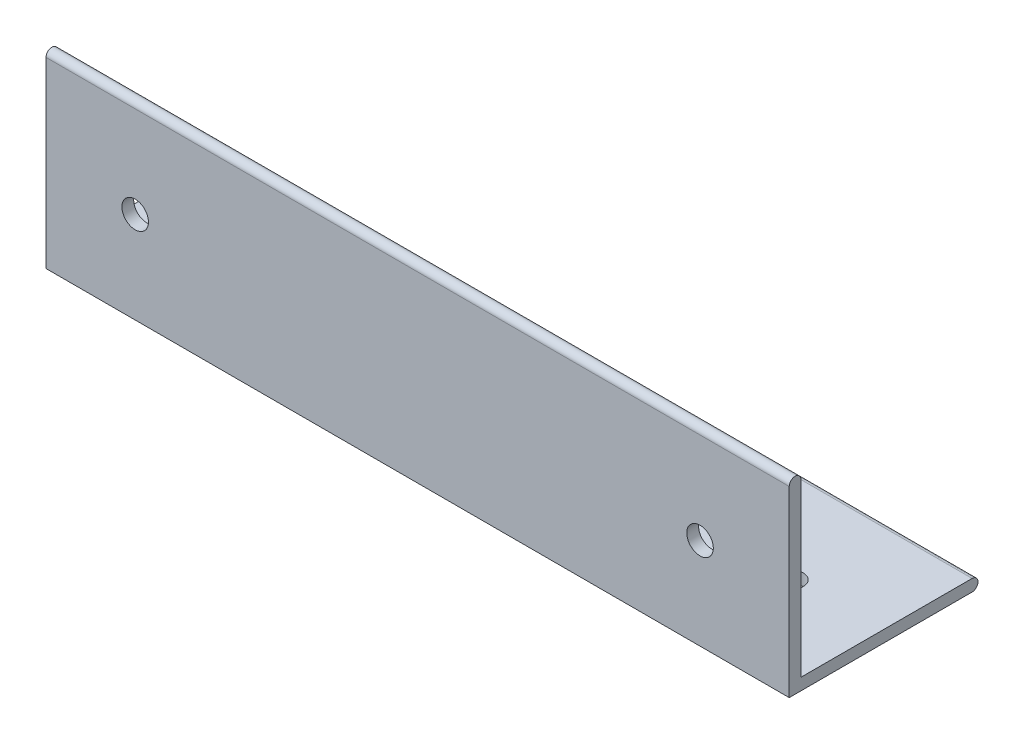
ISO-10303-21;
HEADER;
FILE_DESCRIPTION(('STEP AP214'),'2;1');
FILE_NAME('part.step','',(''),(''),'','','');
FILE_SCHEMA(('AUTOMOTIVE_DESIGN { 1 0 10303 214 1 1 1 1 }'));
ENDSEC;
DATA;
#1=APPLICATION_CONTEXT('core data for automotive mechanical design processes');
#2=APPLICATION_PROTOCOL_DEFINITION('international standard','automotive_design',2000,#1);
#3=PRODUCT_CONTEXT('',#1,'mechanical');
#4=PRODUCT('Part','Part','',(#3));
#5=PRODUCT_RELATED_PRODUCT_CATEGORY('part','',(#4));
#6=PRODUCT_DEFINITION_FORMATION('','',#4);
#7=PRODUCT_DEFINITION_CONTEXT('part definition',#1,'design');
#8=PRODUCT_DEFINITION('design','',#6,#7);
#9=PRODUCT_DEFINITION_SHAPE('','',#8);
#10=(LENGTH_UNIT() NAMED_UNIT(*) SI_UNIT(.MILLI.,.METRE.));
#11=(NAMED_UNIT(*) PLANE_ANGLE_UNIT() SI_UNIT($,.RADIAN.));
#12=(NAMED_UNIT(*) SI_UNIT($,.STERADIAN.) SOLID_ANGLE_UNIT());
#13=UNCERTAINTY_MEASURE_WITH_UNIT(LENGTH_MEASURE(1.E-05),#10,'distance_accuracy_value','');
#14=(GEOMETRIC_REPRESENTATION_CONTEXT(3) GLOBAL_UNCERTAINTY_ASSIGNED_CONTEXT((#13)) GLOBAL_UNIT_ASSIGNED_CONTEXT((#10,
#11,#12)) REPRESENTATION_CONTEXT('',''));
#15=CARTESIAN_POINT('',(0.,0.,0.));
#16=DIRECTION('',(0.,0.,1.));
#17=DIRECTION('',(1.,0.,0.));
#18=AXIS2_PLACEMENT_3D('',#15,#16,#17);
#19=CARTESIAN_POINT('',(100.,0.793749999999999,-24.60625));
#20=DIRECTION('',(-1.,0.,0.));
#21=DIRECTION('',(0.,0.,1.));
#22=AXIS2_PLACEMENT_3D('',#19,#20,#21);
#23=CYLINDRICAL_SURFACE('',#22,0.793749999999999);
#24=DIRECTION('',(-1.,0.,0.));
#25=VECTOR('',#24,1.);
#26=CARTESIAN_POINT('',(100.,1.5875,-24.60625));
#27=LINE('',#26,#25);
#28=CARTESIAN_POINT('',(100.,1.5875,-24.60625));
#29=VERTEX_POINT('',#28);
#30=CARTESIAN_POINT('',(0.,1.5875,-24.60625));
#31=VERTEX_POINT('',#30);
#32=EDGE_CURVE('E149',#29,#31,#27,.T.);
#33=ORIENTED_EDGE('',*,*,#32,.F.);
#34=CARTESIAN_POINT('',(100.,0.793749999999999,-24.60625));
#35=DIRECTION('',(-1.,0.,0.));
#36=DIRECTION('',(0.,0.,1.));
#37=AXIS2_PLACEMENT_3D('',#34,#35,#36);
#38=CIRCLE('',#37,0.793749999999999);
#39=CARTESIAN_POINT('',(100.,0.,-24.60625));
#40=VERTEX_POINT('',#39);
#41=EDGE_CURVE('E58',#40,#29,#38,.F.);
#42=ORIENTED_EDGE('',*,*,#41,.F.);
#43=DIRECTION('',(-1.,0.,0.));
#44=VECTOR('',#43,1.);
#45=CARTESIAN_POINT('',(100.,0.,-24.60625));
#46=LINE('',#45,#44);
#47=CARTESIAN_POINT('',(0.,0.,-24.60625));
#48=VERTEX_POINT('',#47);
#49=EDGE_CURVE('E151',#48,#40,#46,.F.);
#50=ORIENTED_EDGE('',*,*,#49,.F.);
#51=CARTESIAN_POINT('',(0.,0.793749999999999,-24.60625));
#52=DIRECTION('',(-1.,0.,0.));
#53=DIRECTION('',(0.,0.,1.));
#54=AXIS2_PLACEMENT_3D('',#51,#52,#53);
#55=CIRCLE('',#54,0.793749999999999);
#56=EDGE_CURVE('E13',#31,#48,#55,.T.);
#57=ORIENTED_EDGE('',*,*,#56,.F.);
#58=EDGE_LOOP('',(#33,#42,#50,#57));
#59=FACE_BOUND('',#58,.T.);
#60=ADVANCED_FACE('F49',(#59),#23,.T.);
#61=CARTESIAN_POINT('',(100.,24.60625,-0.79375));
#62=DIRECTION('',(-1.,0.,0.));
#63=DIRECTION('',(0.,0.,1.));
#64=AXIS2_PLACEMENT_3D('',#61,#62,#63);
#65=CYLINDRICAL_SURFACE('',#64,0.79375);
#66=DIRECTION('',(-1.,0.,0.));
#67=VECTOR('',#66,1.);
#68=CARTESIAN_POINT('',(100.,24.60625,0.));
#69=LINE('',#68,#67);
#70=CARTESIAN_POINT('',(100.,24.60625,0.));
#71=VERTEX_POINT('',#70);
#72=CARTESIAN_POINT('',(0.,24.60625,0.));
#73=VERTEX_POINT('',#72);
#74=EDGE_CURVE('E119',#71,#73,#69,.T.);
#75=ORIENTED_EDGE('',*,*,#74,.F.);
#76=CARTESIAN_POINT('',(100.,24.60625,-0.79375));
#77=DIRECTION('',(-1.,0.,0.));
#78=DIRECTION('',(0.,0.,1.));
#79=AXIS2_PLACEMENT_3D('',#76,#77,#78);
#80=CIRCLE('',#79,0.79375);
#81=CARTESIAN_POINT('',(100.,24.60625,-1.5875));
#82=VERTEX_POINT('',#81);
#83=EDGE_CURVE('E145',#82,#71,#80,.F.);
#84=ORIENTED_EDGE('',*,*,#83,.F.);
#85=DIRECTION('',(-1.,0.,0.));
#86=VECTOR('',#85,1.);
#87=CARTESIAN_POINT('',(100.,24.60625,-1.5875));
#88=LINE('',#87,#86);
#89=CARTESIAN_POINT('',(0.,24.60625,-1.5875));
#90=VERTEX_POINT('',#89);
#91=EDGE_CURVE('E125',#90,#82,#88,.F.);
#92=ORIENTED_EDGE('',*,*,#91,.F.);
#93=CARTESIAN_POINT('',(0.,24.60625,-0.79375));
#94=DIRECTION('',(-1.,0.,0.));
#95=DIRECTION('',(0.,0.,1.));
#96=AXIS2_PLACEMENT_3D('',#93,#94,#95);
#97=CIRCLE('',#96,0.79375);
#98=EDGE_CURVE('E147',#73,#90,#97,.T.);
#99=ORIENTED_EDGE('',*,*,#98,.F.);
#100=EDGE_LOOP('',(#75,#84,#92,#99));
#101=FACE_BOUND('',#100,.T.);
#102=ADVANCED_FACE('F186',(#101),#65,.T.);
#103=CARTESIAN_POINT('',(100.,0.,-25.4));
#104=DIRECTION('',(0.,1.,0.));
#105=DIRECTION('',(0.,0.,1.));
#106=AXIS2_PLACEMENT_3D('',#103,#104,#105);
#107=PLANE('',#106);
#108=CARTESIAN_POINT('',(12.,0.,-12.303125));
#109=DIRECTION('',(0.,-1.,0.));
#110=DIRECTION('',(0.,0.,-1.));
#111=AXIS2_PLACEMENT_3D('',#108,#109,#110);
#112=CIRCLE('',#111,1.785);
#113=CARTESIAN_POINT('',(12.,0.,-14.088125));
#114=VERTEX_POINT('',#113);
#115=EDGE_CURVE('E155',#114,#114,#112,.T.);
#116=ORIENTED_EDGE('',*,*,#115,.F.);
#117=EDGE_LOOP('',(#116));
#118=FACE_BOUND('',#117,.T.);
#119=CARTESIAN_POINT('',(88.,0.,-12.303125));
#120=DIRECTION('',(0.,-1.,0.));
#121=DIRECTION('',(0.,0.,-1.));
#122=AXIS2_PLACEMENT_3D('',#119,#120,#121);
#123=CIRCLE('',#122,1.5875);
#124=CARTESIAN_POINT('',(88.,0.,-13.890625));
#125=VERTEX_POINT('',#124);
#126=EDGE_CURVE('E161',#125,#125,#123,.T.);
#127=ORIENTED_EDGE('',*,*,#126,.F.);
#128=EDGE_LOOP('',(#127));
#129=FACE_BOUND('',#128,.T.);
#130=DIRECTION('',(0.,0.,-1.));
#131=VECTOR('',#130,1.);
#132=CARTESIAN_POINT('',(0.,0.,-25.4));
#133=LINE('',#132,#131);
#134=CARTESIAN_POINT('',(0.,0.,0.));
#135=VERTEX_POINT('',#134);
#136=EDGE_CURVE('E131',#135,#48,#133,.T.);
#137=ORIENTED_EDGE('',*,*,#136,.T.);
#138=ORIENTED_EDGE('',*,*,#49,.T.);
#139=DIRECTION('',(0.,0.,-1.));
#140=VECTOR('',#139,1.);
#141=CARTESIAN_POINT('',(100.,0.,-25.4));
#142=LINE('',#141,#140);
#143=CARTESIAN_POINT('',(100.,0.,0.));
#144=VERTEX_POINT('',#143);
#145=EDGE_CURVE('E110',#144,#40,#142,.T.);
#146=ORIENTED_EDGE('',*,*,#145,.F.);
#147=DIRECTION('',(-1.,0.,0.));
#148=VECTOR('',#147,1.);
#149=CARTESIAN_POINT('',(100.,0.,0.));
#150=LINE('',#149,#148);
#151=EDGE_CURVE('E120',#144,#135,#150,.T.);
#152=ORIENTED_EDGE('',*,*,#151,.T.);
#153=EDGE_LOOP('',(#137,#138,#146,#152));
#154=FACE_BOUND('',#153,.T.);
#155=ADVANCED_FACE('F181',(#118,#129,#154),#107,.F.);
#156=CARTESIAN_POINT('',(100.,1.5875,-1.5875));
#157=DIRECTION('',(0.,-1.,0.));
#158=DIRECTION('',(0.,0.,-1.));
#159=AXIS2_PLACEMENT_3D('',#156,#157,#158);
#160=PLANE('',#159);
#161=CARTESIAN_POINT('',(12.,1.5875,-12.303125));
#162=DIRECTION('',(0.,-1.,0.));
#163=DIRECTION('',(0.,0.,-1.));
#164=AXIS2_PLACEMENT_3D('',#161,#162,#163);
#165=CIRCLE('',#164,1.785);
#166=CARTESIAN_POINT('',(12.,1.5875,-14.088125));
#167=VERTEX_POINT('',#166);
#168=EDGE_CURVE('E53',#167,#167,#165,.T.);
#169=ORIENTED_EDGE('',*,*,#168,.T.);
#170=EDGE_LOOP('',(#169));
#171=FACE_BOUND('',#170,.T.);
#172=CARTESIAN_POINT('',(88.,1.5875,-12.303125));
#173=DIRECTION('',(0.,-1.,0.));
#174=DIRECTION('',(0.,0.,-1.));
#175=AXIS2_PLACEMENT_3D('',#172,#173,#174);
#176=CIRCLE('',#175,1.5875);
#177=CARTESIAN_POINT('',(88.,1.5875,-13.890625));
#178=VERTEX_POINT('',#177);
#179=EDGE_CURVE('E153',#178,#178,#176,.T.);
#180=ORIENTED_EDGE('',*,*,#179,.T.);
#181=EDGE_LOOP('',(#180));
#182=FACE_BOUND('',#181,.T.);
#183=DIRECTION('',(0.,0.,1.));
#184=VECTOR('',#183,1.);
#185=CARTESIAN_POINT('',(100.,1.5875,-1.5875));
#186=LINE('',#185,#184);
#187=CARTESIAN_POINT('',(100.,1.5875,-1.5875));
#188=VERTEX_POINT('',#187);
#189=EDGE_CURVE('E102',#29,#188,#186,.T.);
#190=ORIENTED_EDGE('',*,*,#189,.F.);
#191=ORIENTED_EDGE('',*,*,#32,.T.);
#192=DIRECTION('',(0.,0.,1.));
#193=VECTOR('',#192,1.);
#194=CARTESIAN_POINT('',(0.,1.5875,-1.5875));
#195=LINE('',#194,#193);
#196=CARTESIAN_POINT('',(0.,1.5875,-1.5875));
#197=VERTEX_POINT('',#196);
#198=EDGE_CURVE('E115',#31,#197,#195,.T.);
#199=ORIENTED_EDGE('',*,*,#198,.T.);
#200=DIRECTION('',(-1.,0.,0.));
#201=VECTOR('',#200,1.);
#202=CARTESIAN_POINT('',(100.,1.5875,-1.5875));
#203=LINE('',#202,#201);
#204=EDGE_CURVE('E113',#188,#197,#203,.T.);
#205=ORIENTED_EDGE('',*,*,#204,.F.);
#206=EDGE_LOOP('',(#190,#191,#199,#205));
#207=FACE_BOUND('',#206,.T.);
#208=ADVANCED_FACE('F114',(#171,#182,#207),#160,.F.);
#209=CARTESIAN_POINT('',(100.,25.4,-1.5875));
#210=DIRECTION('',(0.,0.,1.));
#211=DIRECTION('',(0.,-1.,0.));
#212=AXIS2_PLACEMENT_3D('',#209,#210,#211);
#213=PLANE('',#212);
#214=CARTESIAN_POINT('',(88.,12.303125,-1.5875));
#215=DIRECTION('',(0.,0.,1.));
#216=DIRECTION('',(0.,-1.,0.));
#217=AXIS2_PLACEMENT_3D('',#214,#215,#216);
#218=CIRCLE('',#217,1.7859375);
#219=CARTESIAN_POINT('',(88.,10.5171875,-1.5875));
#220=VERTEX_POINT('',#219);
#221=EDGE_CURVE('E170',#220,#220,#218,.F.);
#222=ORIENTED_EDGE('',*,*,#221,.F.);
#223=EDGE_LOOP('',(#222));
#224=FACE_BOUND('',#223,.T.);
#225=CARTESIAN_POINT('',(12.,12.303125,-1.5875));
#226=DIRECTION('',(0.,0.,1.));
#227=DIRECTION('',(0.,-1.,0.));
#228=AXIS2_PLACEMENT_3D('',#225,#226,#227);
#229=CIRCLE('',#228,1.7859375);
#230=CARTESIAN_POINT('',(12.,10.5171875,-1.5875));
#231=VERTEX_POINT('',#230);
#232=EDGE_CURVE('E134',#231,#231,#229,.T.);
#233=ORIENTED_EDGE('',*,*,#232,.T.);
#234=EDGE_LOOP('',(#233));
#235=FACE_BOUND('',#234,.T.);
#236=DIRECTION('',(0.,1.,0.));
#237=VECTOR('',#236,1.);
#238=CARTESIAN_POINT('',(0.,25.4,-1.5875));
#239=LINE('',#238,#237);
#240=EDGE_CURVE('E136',#197,#90,#239,.T.);
#241=ORIENTED_EDGE('',*,*,#240,.T.);
#242=ORIENTED_EDGE('',*,*,#91,.T.);
#243=DIRECTION('',(0.,1.,0.));
#244=VECTOR('',#243,1.);
#245=CARTESIAN_POINT('',(100.,25.4,-1.5875));
#246=LINE('',#245,#244);
#247=EDGE_CURVE('E107',#188,#82,#246,.T.);
#248=ORIENTED_EDGE('',*,*,#247,.F.);
#249=ORIENTED_EDGE('',*,*,#204,.T.);
#250=EDGE_LOOP('',(#241,#242,#248,#249));
#251=FACE_BOUND('',#250,.T.);
#252=ADVANCED_FACE('F123',(#224,#235,#251),#213,.F.);
#253=CARTESIAN_POINT('',(100.,0.,0.));
#254=DIRECTION('',(0.,0.,-1.));
#255=DIRECTION('',(-1.,0.,0.));
#256=AXIS2_PLACEMENT_3D('',#253,#254,#255);
#257=PLANE('',#256);
#258=CARTESIAN_POINT('',(88.,12.303125,0.));
#259=DIRECTION('',(0.,0.,-1.));
#260=DIRECTION('',(-1.,0.,0.));
#261=AXIS2_PLACEMENT_3D('',#258,#259,#260);
#262=CIRCLE('',#261,1.7859375);
#263=CARTESIAN_POINT('',(86.2140625,12.303125,0.));
#264=VERTEX_POINT('',#263);
#265=EDGE_CURVE('E159',#264,#264,#262,.T.);
#266=ORIENTED_EDGE('',*,*,#265,.T.);
#267=EDGE_LOOP('',(#266));
#268=FACE_BOUND('',#267,.T.);
#269=CARTESIAN_POINT('',(12.,12.303125,0.));
#270=DIRECTION('',(0.,0.,1.));
#271=DIRECTION('',(1.,0.,0.));
#272=AXIS2_PLACEMENT_3D('',#269,#270,#271);
#273=CIRCLE('',#272,1.7859375);
#274=CARTESIAN_POINT('',(13.7859375,12.303125,0.));
#275=VERTEX_POINT('',#274);
#276=EDGE_CURVE('E173',#275,#275,#273,.T.);
#277=ORIENTED_EDGE('',*,*,#276,.F.);
#278=EDGE_LOOP('',(#277));
#279=FACE_BOUND('',#278,.T.);
#280=DIRECTION('',(0.,-1.,0.));
#281=VECTOR('',#280,1.);
#282=CARTESIAN_POINT('',(100.,0.,0.));
#283=LINE('',#282,#281);
#284=EDGE_CURVE('E126',#71,#144,#283,.T.);
#285=ORIENTED_EDGE('',*,*,#284,.F.);
#286=ORIENTED_EDGE('',*,*,#74,.T.);
#287=DIRECTION('',(0.,-1.,0.));
#288=VECTOR('',#287,1.);
#289=CARTESIAN_POINT('',(0.,0.,0.));
#290=LINE('',#289,#288);
#291=EDGE_CURVE('E138',#73,#135,#290,.T.);
#292=ORIENTED_EDGE('',*,*,#291,.T.);
#293=ORIENTED_EDGE('',*,*,#151,.F.);
#294=EDGE_LOOP('',(#285,#286,#292,#293));
#295=FACE_BOUND('',#294,.T.);
#296=ADVANCED_FACE('F188',(#268,#279,#295),#257,.F.);
#297=CARTESIAN_POINT('',(100.,0.,0.));
#298=DIRECTION('',(-1.,0.,0.));
#299=DIRECTION('',(0.,0.,1.));
#300=AXIS2_PLACEMENT_3D('',#297,#298,#299);
#301=PLANE('',#300);
#302=ORIENTED_EDGE('',*,*,#145,.T.);
#303=ORIENTED_EDGE('',*,*,#41,.T.);
#304=ORIENTED_EDGE('',*,*,#189,.T.);
#305=ORIENTED_EDGE('',*,*,#247,.T.);
#306=ORIENTED_EDGE('',*,*,#83,.T.);
#307=ORIENTED_EDGE('',*,*,#284,.T.);
#308=EDGE_LOOP('',(#302,#303,#304,#305,#306,#307));
#309=FACE_BOUND('',#308,.T.);
#310=ADVANCED_FACE('F105',(#309),#301,.F.);
#311=CARTESIAN_POINT('',(0.,0.,0.));
#312=DIRECTION('',(-1.,0.,0.));
#313=DIRECTION('',(0.,0.,1.));
#314=AXIS2_PLACEMENT_3D('',#311,#312,#313);
#315=PLANE('',#314);
#316=ORIENTED_EDGE('',*,*,#198,.F.);
#317=ORIENTED_EDGE('',*,*,#56,.T.);
#318=ORIENTED_EDGE('',*,*,#136,.F.);
#319=ORIENTED_EDGE('',*,*,#291,.F.);
#320=ORIENTED_EDGE('',*,*,#98,.T.);
#321=ORIENTED_EDGE('',*,*,#240,.F.);
#322=EDGE_LOOP('',(#316,#317,#318,#319,#320,#321));
#323=FACE_BOUND('',#322,.T.);
#324=ADVANCED_FACE('F182',(#323),#315,.T.);
#325=CARTESIAN_POINT('',(12.,12.303125,-25.4));
#326=DIRECTION('',(0.,0.,1.));
#327=DIRECTION('',(1.,0.,0.));
#328=AXIS2_PLACEMENT_3D('',#325,#326,#327);
#329=CYLINDRICAL_SURFACE('',#328,1.7859375);
#330=ORIENTED_EDGE('',*,*,#276,.T.);
#331=EDGE_LOOP('',(#330));
#332=FACE_BOUND('',#331,.T.);
#333=ORIENTED_EDGE('',*,*,#232,.F.);
#334=EDGE_LOOP('',(#333));
#335=FACE_BOUND('',#334,.T.);
#336=ADVANCED_FACE('F233',(#332,#335),#329,.F.);
#337=CARTESIAN_POINT('',(88.,12.303125,-25.4));
#338=DIRECTION('',(0.,0.,1.));
#339=DIRECTION('',(1.,0.,0.));
#340=AXIS2_PLACEMENT_3D('',#337,#338,#339);
#341=CYLINDRICAL_SURFACE('',#340,1.7859375);
#342=ORIENTED_EDGE('',*,*,#265,.F.);
#343=EDGE_LOOP('',(#342));
#344=FACE_BOUND('',#343,.T.);
#345=ORIENTED_EDGE('',*,*,#221,.T.);
#346=EDGE_LOOP('',(#345));
#347=FACE_BOUND('',#346,.T.);
#348=ADVANCED_FACE('F227',(#344,#347),#341,.F.);
#349=CARTESIAN_POINT('',(88.,25.4,-12.303125));
#350=DIRECTION('',(0.,-1.,0.));
#351=DIRECTION('',(0.,0.,-1.));
#352=AXIS2_PLACEMENT_3D('',#349,#350,#351);
#353=CYLINDRICAL_SURFACE('',#352,1.5875);
#354=ORIENTED_EDGE('',*,*,#126,.T.);
#355=EDGE_LOOP('',(#354));
#356=FACE_BOUND('',#355,.T.);
#357=ORIENTED_EDGE('',*,*,#179,.F.);
#358=EDGE_LOOP('',(#357));
#359=FACE_BOUND('',#358,.T.);
#360=ADVANCED_FACE('F222',(#356,#359),#353,.F.);
#361=CARTESIAN_POINT('',(12.,25.4,-12.303125));
#362=DIRECTION('',(0.,-1.,0.));
#363=DIRECTION('',(0.,0.,-1.));
#364=AXIS2_PLACEMENT_3D('',#361,#362,#363);
#365=CYLINDRICAL_SURFACE('',#364,1.785);
#366=ORIENTED_EDGE('',*,*,#115,.T.);
#367=EDGE_LOOP('',(#366));
#368=FACE_BOUND('',#367,.T.);
#369=ORIENTED_EDGE('',*,*,#168,.F.);
#370=EDGE_LOOP('',(#369));
#371=FACE_BOUND('',#370,.T.);
#372=ADVANCED_FACE('F220',(#368,#371),#365,.F.);
#373=CLOSED_SHELL('',(#60,#102,#155,#208,#252,#296,#310,#324,#336,#348,#360,#372));
#374=MANIFOLD_SOLID_BREP('B2',#373);
#375=ADVANCED_BREP_SHAPE_REPRESENTATION('',(#18,#374),#14);
#376=SHAPE_DEFINITION_REPRESENTATION(#9,#375);
ENDSEC;
END-ISO-10303-21;
